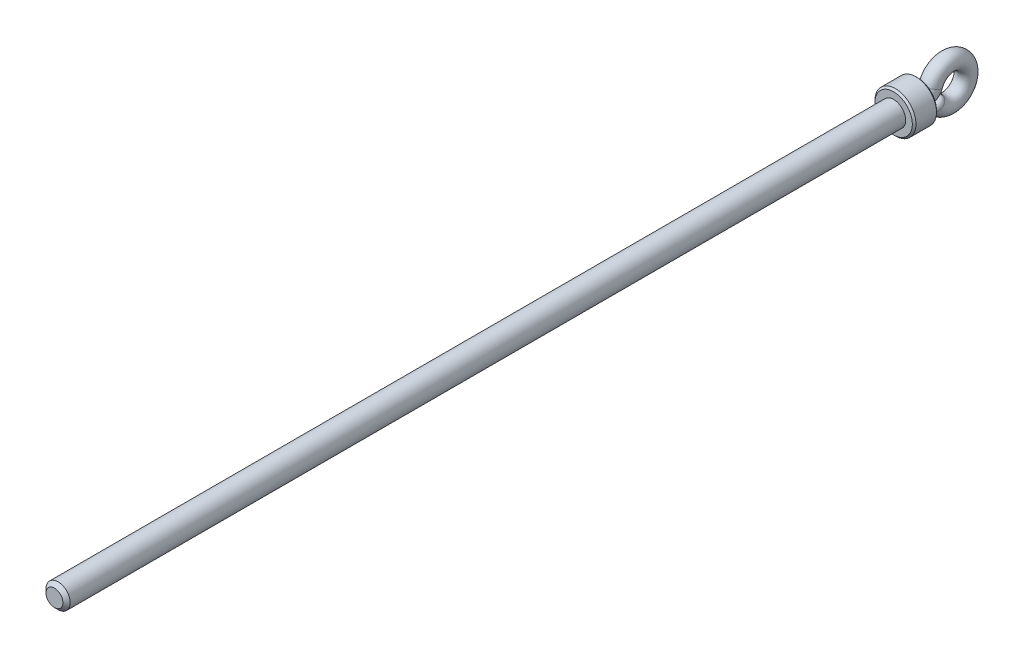
ISO-10303-21;
HEADER;
FILE_DESCRIPTION(('STEP AP214'),'2;1');
FILE_NAME('part.step','',(''),(''),'','','');
FILE_SCHEMA(('AUTOMOTIVE_DESIGN { 1 0 10303 214 1 1 1 1 }'));
ENDSEC;
DATA;
#1=APPLICATION_CONTEXT('core data for automotive mechanical design processes');
#2=APPLICATION_PROTOCOL_DEFINITION('international standard','automotive_design',2000,#1);
#3=PRODUCT_CONTEXT('',#1,'mechanical');
#4=PRODUCT('Part','Part','',(#3));
#5=PRODUCT_RELATED_PRODUCT_CATEGORY('part','',(#4));
#6=PRODUCT_DEFINITION_FORMATION('','',#4);
#7=PRODUCT_DEFINITION_CONTEXT('part definition',#1,'design');
#8=PRODUCT_DEFINITION('design','',#6,#7);
#9=PRODUCT_DEFINITION_SHAPE('','',#8);
#10=(LENGTH_UNIT() NAMED_UNIT(*) SI_UNIT(.MILLI.,.METRE.));
#11=(NAMED_UNIT(*) PLANE_ANGLE_UNIT() SI_UNIT($,.RADIAN.));
#12=(NAMED_UNIT(*) SI_UNIT($,.STERADIAN.) SOLID_ANGLE_UNIT());
#13=UNCERTAINTY_MEASURE_WITH_UNIT(LENGTH_MEASURE(1.E-05),#10,'distance_accuracy_value','');
#14=(GEOMETRIC_REPRESENTATION_CONTEXT(3) GLOBAL_UNCERTAINTY_ASSIGNED_CONTEXT((#13)) GLOBAL_UNIT_ASSIGNED_CONTEXT((#10,
#11,#12)) REPRESENTATION_CONTEXT('',''));
#15=CARTESIAN_POINT('',(0.,0.,0.));
#16=DIRECTION('',(0.,0.,1.));
#17=DIRECTION('',(1.,0.,0.));
#18=AXIS2_PLACEMENT_3D('',#15,#16,#17);
#19=CARTESIAN_POINT('',(0.,0.,695.));
#20=DIRECTION('',(0.,0.,-1.));
#21=DIRECTION('',(-1.,0.,0.));
#22=AXIS2_PLACEMENT_3D('',#19,#20,#21);
#23=CYLINDRICAL_SURFACE('',#22,10.);
#24=CARTESIAN_POINT('',(0.,0.,692.));
#25=DIRECTION('',(0.,0.,1.));
#26=DIRECTION('',(1.,0.,0.));
#27=AXIS2_PLACEMENT_3D('',#24,#25,#26);
#28=CIRCLE('',#27,10.);
#29=CARTESIAN_POINT('',(10.,0.,692.));
#30=VERTEX_POINT('',#29);
#31=EDGE_CURVE('E27',#30,#30,#28,.F.);
#32=ORIENTED_EDGE('',*,*,#31,.T.);
#33=EDGE_LOOP('',(#32));
#34=FACE_BOUND('',#33,.T.);
#35=CARTESIAN_POINT('',(0.,0.,0.));
#36=DIRECTION('',(0.,0.,1.));
#37=DIRECTION('',(1.,0.,0.));
#38=AXIS2_PLACEMENT_3D('',#35,#36,#37);
#39=CIRCLE('',#38,10.);
#40=CARTESIAN_POINT('',(10.,0.,0.));
#41=VERTEX_POINT('',#40);
#42=EDGE_CURVE('E130',#41,#41,#39,.T.);
#43=ORIENTED_EDGE('',*,*,#42,.T.);
#44=EDGE_LOOP('',(#43));
#45=FACE_BOUND('',#44,.T.);
#46=ADVANCED_FACE('F12',(#34,#45),#23,.T.);
#47=CARTESIAN_POINT('',(0.,0.,695.));
#48=DIRECTION('',(0.,0.,1.));
#49=DIRECTION('',(1.,0.,0.));
#50=AXIS2_PLACEMENT_3D('',#47,#48,#49);
#51=PLANE('',#50);
#52=CARTESIAN_POINT('',(0.,0.,695.));
#53=DIRECTION('',(0.,0.,1.));
#54=DIRECTION('',(1.,0.,0.));
#55=AXIS2_PLACEMENT_3D('',#52,#53,#54);
#56=CIRCLE('',#55,7.);
#57=CARTESIAN_POINT('',(7.,0.,695.));
#58=VERTEX_POINT('',#57);
#59=EDGE_CURVE('E110',#58,#58,#56,.T.);
#60=ORIENTED_EDGE('',*,*,#59,.T.);
#61=EDGE_LOOP('',(#60));
#62=FACE_BOUND('',#61,.T.);
#63=ADVANCED_FACE('F77',(#62),#51,.T.);
#64=CARTESIAN_POINT('',(0.,0.,-20.));
#65=DIRECTION('',(0.,0.,1.));
#66=DIRECTION('',(1.,0.,0.));
#67=AXIS2_PLACEMENT_3D('',#64,#65,#66);
#68=CYLINDRICAL_SURFACE('',#67,17.);
#69=CARTESIAN_POINT('',(0.,0.,-1.49999999999992));
#70=DIRECTION('',(0.,0.,1.));
#71=DIRECTION('',(1.,0.,0.));
#72=AXIS2_PLACEMENT_3D('',#69,#70,#71);
#73=CIRCLE('',#72,17.);
#74=CARTESIAN_POINT('',(17.,0.,-1.49999999999992));
#75=VERTEX_POINT('',#74);
#76=EDGE_CURVE('E121',#75,#75,#73,.F.);
#77=ORIENTED_EDGE('',*,*,#76,.T.);
#78=EDGE_LOOP('',(#77));
#79=FACE_BOUND('',#78,.T.);
#80=CARTESIAN_POINT('',(0.,0.,-18.5));
#81=DIRECTION('',(0.,0.,1.));
#82=DIRECTION('',(1.,0.,0.));
#83=AXIS2_PLACEMENT_3D('',#80,#81,#82);
#84=CIRCLE('',#83,17.);
#85=CARTESIAN_POINT('',(17.,0.,-18.5));
#86=VERTEX_POINT('',#85);
#87=EDGE_CURVE('E124',#86,#86,#84,.T.);
#88=ORIENTED_EDGE('',*,*,#87,.T.);
#89=EDGE_LOOP('',(#88));
#90=FACE_BOUND('',#89,.T.);
#91=ADVANCED_FACE('F84',(#79,#90),#68,.T.);
#92=CARTESIAN_POINT('',(0.,0.,-20.));
#93=DIRECTION('',(0.,0.,1.));
#94=DIRECTION('',(1.,0.,0.));
#95=AXIS2_PLACEMENT_3D('',#92,#93,#94);
#96=PLANE('',#95);
#97=CARTESIAN_POINT('',(0.,0.,-20.));
#98=DIRECTION('',(0.,0.,1.));
#99=DIRECTION('',(1.,0.,0.));
#100=AXIS2_PLACEMENT_3D('',#97,#98,#99);
#101=CIRCLE('',#100,9.);
#102=CARTESIAN_POINT('',(9.,0.,-20.));
#103=VERTEX_POINT('',#102);
#104=EDGE_CURVE('E113',#103,#103,#101,.T.);
#105=ORIENTED_EDGE('',*,*,#104,.T.);
#106=EDGE_LOOP('',(#105));
#107=FACE_BOUND('',#106,.T.);
#108=CARTESIAN_POINT('',(0.,0.,-20.));
#109=DIRECTION('',(0.,0.,1.));
#110=DIRECTION('',(1.,0.,0.));
#111=AXIS2_PLACEMENT_3D('',#108,#109,#110);
#112=CIRCLE('',#111,15.5);
#113=CARTESIAN_POINT('',(15.5,0.,-20.));
#114=VERTEX_POINT('',#113);
#115=EDGE_CURVE('E118',#114,#114,#112,.F.);
#116=ORIENTED_EDGE('',*,*,#115,.T.);
#117=EDGE_LOOP('',(#116));
#118=FACE_BOUND('',#117,.T.);
#119=ADVANCED_FACE('F145',(#107,#118),#96,.F.);
#120=CARTESIAN_POINT('',(0.,0.,0.));
#121=DIRECTION('',(0.,0.,1.));
#122=DIRECTION('',(1.,0.,0.));
#123=AXIS2_PLACEMENT_3D('',#120,#121,#122);
#124=PLANE('',#123);
#125=CARTESIAN_POINT('',(0.,0.,0.));
#126=DIRECTION('',(0.,0.,1.));
#127=DIRECTION('',(1.,0.,0.));
#128=AXIS2_PLACEMENT_3D('',#125,#126,#127);
#129=CIRCLE('',#128,15.5);
#130=CARTESIAN_POINT('',(15.5,0.,0.));
#131=VERTEX_POINT('',#130);
#132=EDGE_CURVE('E127',#131,#131,#129,.T.);
#133=ORIENTED_EDGE('',*,*,#132,.T.);
#134=EDGE_LOOP('',(#133));
#135=FACE_BOUND('',#134,.T.);
#136=ORIENTED_EDGE('',*,*,#42,.F.);
#137=EDGE_LOOP('',(#136));
#138=FACE_BOUND('',#137,.T.);
#139=ADVANCED_FACE('F61',(#135,#138),#124,.T.);
#140=CARTESIAN_POINT('',(0.,-5.6190989012386,-31.0922421814982));
#141=DIRECTION('',(0.,-0.92718385456679,-0.374606593415906));
#142=DIRECTION('',(0.,0.374606593415906,-0.92718385456679));
#143=AXIS2_PLACEMENT_3D('',#140,#141,#142);
#144=PLANE('',#143);
#145=CARTESIAN_POINT('',(-0.26781489975325,-4.24294874486967,-34.4983333418537));
#146=CARTESIAN_POINT('',(-0.535964039163624,-3.18618303783896,-37.1139202504667));
#147=CARTESIAN_POINT('',(-0.624901432757583,-5.31433814850182,-38.9828767941055));
#148=CARTESIAN_POINT('',(-0.106699811893944,-4.23721080551918,-34.5125352401058));
#149=CARTESIAN_POINT('',(-0.213372702047784,-3.17709115436086,-37.1364234517361));
#150=CARTESIAN_POINT('',(-0.248966227724355,-5.29458411469506,-39.010392555168));
#151=CARTESIAN_POINT('',(0.0557192743773804,-4.23666309919185,-34.5138908608361));
#152=CARTESIAN_POINT('',(0.111416626490463,-3.17622472220717,-37.1385679465691));
#153=CARTESIAN_POINT('',(0.130011640243445,-5.29269527178392,-39.0130149226403));
#154=CARTESIAN_POINT('',(0.37840606743683,-4.2459646647267,-34.4908686782646));
#155=CARTESIAN_POINT('',(0.757583451588221,-3.1909667929823,-37.1020800410014));
#156=CARTESIAN_POINT('',(0.88294749069947,-5.32472333482807,-38.9684170545827));
#157=CARTESIAN_POINT('',(0.538674013800433,-4.25581276889775,-34.4664937650998));
#158=CARTESIAN_POINT('',(1.07983936736786,-3.20661368418199,-37.0633526262963));
#159=CARTESIAN_POINT('',(1.25690603219714,-5.35863621941737,-38.9212024169066));
#160=CARTESIAN_POINT('',(0.850088972014334,-4.28527806984583,-34.3935645860912));
#161=CARTESIAN_POINT('',(1.71070497526708,-3.25374810830346,-36.9466908328098));
#162=CARTESIAN_POINT('',(1.98354093470391,-5.4597559099278,-38.7795031073017));
#163=CARTESIAN_POINT('',(1.00133655074528,-4.30474694972162,-34.3453774174599));
#164=CARTESIAN_POINT('',(2.02022082468755,-3.28511609734603,-36.8690523355125));
#165=CARTESIAN_POINT('',(2.33645195176722,-5.52645716066194,-38.6857360033921));
#166=CARTESIAN_POINT('',(1.29332499429875,-4.35265493436787,-34.2268009944883));
#167=CARTESIAN_POINT('',(2.62575498343677,-3.36316682901066,-36.6758699956698));
#168=CARTESIAN_POINT('',(3.01775832005989,-5.68980738952441,-38.4540301378223));
#169=CARTESIAN_POINT('',(1.43406464981,-4.38109506963931,-34.1564091895686));
#170=CARTESIAN_POINT('',(2.92236085455471,-3.41003385837553,-36.5598700274301));
#171=CARTESIAN_POINT('',(3.34615084956293,-5.78645980803031,-38.3160863016868));
#172=CARTESIAN_POINT('',(1.70559193340705,-4.44694228423317,-33.9934316143933));
#173=CARTESIAN_POINT('',(3.50581556944885,-3.52019578102392,-36.287209700936));
#174=CARTESIAN_POINT('',(3.97971451127665,-6.00891158281849,-37.99509911499));
#175=CARTESIAN_POINT('',(1.8359668712502,-4.48458778863466,-33.9002557213589));
#176=CARTESIAN_POINT('',(3.79246172010585,-3.58416094446186,-36.1288903658342));
#177=CARTESIAN_POINT('',(4.28392269958882,-6.13548232047447,-37.8108522184166));
#178=CARTESIAN_POINT('',(2.07903816647017,-4.56717462556752,-33.6958461270011));
#179=CARTESIAN_POINT('',(4.34129872883697,-3.72715987201688,-35.7749556001901));
#180=CARTESIAN_POINT('',(4.85108905510651,-6.41121009640482,-37.404353267778));
#181=CARTESIAN_POINT('',(2.19173041569785,-4.61211764858217,-33.5846082415848));
#182=CARTESIAN_POINT('',(4.60364524530678,-3.80646547441347,-35.5786673462961));
#183=CARTESIAN_POINT('',(5.1140376366307,-6.56037236750889,-37.182092407072));
#184=CARTESIAN_POINT('',(2.4023148160031,-4.71048518827117,-33.3411400372976));
#185=CARTESIAN_POINT('',(5.1114247936726,-3.98388725587502,-35.1395330274908));
#186=CARTESIAN_POINT('',(5.60540123733802,-6.88438053582401,-36.6927903523806));
#187=CARTESIAN_POINT('',(2.49915407592638,-4.76422609928738,-33.2081266149508));
#188=CARTESIAN_POINT('',(5.35503971113458,-4.08300472606899,-34.8942086800699));
#189=CARTESIAN_POINT('',(5.83135951049496,-7.06015030018004,-36.4240392911956));
#190=CARTESIAN_POINT('',(2.6685229621291,-4.87683900319798,-32.9293998969566));
#191=CARTESIAN_POINT('',(5.80290163873662,-4.29594611758229,-34.3671602413871));
#192=CARTESIAN_POINT('',(6.22655357830285,-7.42544617922707,-35.8575021364479));
#193=CARTESIAN_POINT('',(2.74104712599448,-4.93571214531601,-32.783683756881));
#194=CARTESIAN_POINT('',(6.00674674067441,-4.41005227440125,-34.0847375927507));
#195=CARTESIAN_POINT('',(6.39577662732097,-7.61497537337143,-35.559709538041));
#196=CARTESIAN_POINT('',(2.86267410632611,-5.05958707808985,-32.4770825393046));
#197=CARTESIAN_POINT('',(6.37581947811974,-4.65663337946306,-33.4744279413113));
#198=CARTESIAN_POINT('',(6.67957291476038,-8.01050509923216,-34.9296020277956));
#199=CARTESIAN_POINT('',(2.91066484290466,-5.1247424378163,-32.3158173650161));
#200=CARTESIAN_POINT('',(6.53823980201787,-4.78984889319113,-33.1447079746118));
#201=CARTESIAN_POINT('',(6.79155130011043,-8.21686310599564,-34.5963623398275));
#202=CARTESIAN_POINT('',(2.97723912694889,-5.25713277767882,-31.988139775303));
#203=CARTESIAN_POINT('',(6.80459024537532,-5.06828018911196,-32.4555663344985));
#204=CARTESIAN_POINT('',(6.94689129621409,-8.63273005456193,-33.9156505539855));
#205=CARTESIAN_POINT('',(2.99581930203228,-5.32436799540215,-31.8217267718294));
#206=CARTESIAN_POINT('',(6.90756393001704,-5.21365603767942,-32.095748482905));
#207=CARTESIAN_POINT('',(6.99024503807571,-8.84223935492986,-33.5681768286417));
#208=CARTESIAN_POINT('',(3.00297095485652,-5.46003619821919,-31.4859361866104));
#209=CARTESIAN_POINT('',(7.04792453219719,-5.51541300187754,-31.3488737878914));
#210=CARTESIAN_POINT('',(7.00693222799816,-9.26175749724208,-32.8637583462609));
#211=CARTESIAN_POINT('',(2.99110810652139,-5.52847252902019,-31.3165503239488));
#212=CARTESIAN_POINT('',(7.08320525408175,-5.67193252423054,-30.9614743758124));
#213=CARTESIAN_POINT('',(6.97925224854835,-9.47173038745556,-32.506749230534));
#214=CARTESIAN_POINT('',(2.93647501381529,-5.66359719160117,-30.9821050480222));
#215=CARTESIAN_POINT('',(7.07764622811232,-5.98967234228319,-30.1750407293434));
#216=CARTESIAN_POINT('',(6.85177503223626,-9.88339870069764,-31.7989770209835));
#217=CARTESIAN_POINT('',(2.89370596052631,-5.73028559064138,-30.8170454682824));
#218=CARTESIAN_POINT('',(7.03563962131795,-6.15079719396174,-29.7762427271952));
#219=CARTESIAN_POINT('',(6.75198057456525,-10.0850944423994,-31.44821368699));
#220=CARTESIAN_POINT('',(2.7788499410562,-5.8590731149157,-30.498285160067));
#221=CARTESIAN_POINT('',(6.87093161465208,-6.47018696868092,-28.9857252946721));
#222=CARTESIAN_POINT('',(6.483983195794,-10.4721971890889,-30.7685131820488));
#223=CARTESIAN_POINT('',(2.70714713847289,-5.9212202351783,-30.3444656397274));
#224=CARTESIAN_POINT('',(6.74822619668567,-6.62826029452504,-28.5944800839996));
#225=CARTESIAN_POINT('',(6.31667665642216,-10.6577803335356,-30.4393533096008));
#226=CARTESIAN_POINT('',(2.53613119994427,-6.03993497912506,-30.0506363376781));
#227=CARTESIAN_POINT('',(6.42064236153452,-6.93744162777072,-27.8292294307615));
#228=CARTESIAN_POINT('',(5.91763946652359,-11.0104370540509,-29.8088517089643));
#229=CARTESIAN_POINT('',(2.43682318052268,-6.09650363412718,-29.9106240033669));
#230=CARTESIAN_POINT('',(6.21498311331832,-7.08820123680676,-27.4560863044102));
#231=CARTESIAN_POINT('',(5.68592075455223,-11.177514052147,-29.5075048395134));
#232=CARTESIAN_POINT('',(2.21636936017603,-6.2007470634353,-29.6526124619313));
#233=CARTESIAN_POINT('',(5.73013766037579,-7.37181670926835,-26.754113377095));
#234=CARTESIAN_POINT('',(5.1715285070781,-11.4840832244933,-28.950979202246));
#235=CARTESIAN_POINT('',(2.09591453127465,-6.24862686251162,-29.5341058006933));
#236=CARTESIAN_POINT('',(5.45269078156247,-7.50469196855701,-26.4252355696854));
#237=CARTESIAN_POINT('',(4.89046723963124,-11.624217886761,-28.6947422138669));
#238=CARTESIAN_POINT('',(1.83464081316523,-6.33585912965116,-29.3181983631025));
#239=CARTESIAN_POINT('',(4.82763579395749,-7.75093360432912,-25.8157661342221));
#240=CARTESIAN_POINT('',(4.28082856405544,-11.8786970961703,-28.22715060489));
#241=CARTESIAN_POINT('',(1.69382006872958,-6.37521082003178,-29.2207995115817));
#242=CARTESIAN_POINT('',(4.48000858770837,-7.8638650581632,-25.5362509775002));
#243=CARTESIAN_POINT('',(3.95224682706208,-11.9930392913223,-28.0158000775467));
#244=CARTESIAN_POINT('',(1.40028972794922,-6.4430518984287,-29.0528869503199));
#245=CARTESIAN_POINT('',(3.73660921746578,-8.06115492934167,-25.0479414110341));
#246=CARTESIAN_POINT('',(3.26734269852263,-12.1896978973501,-27.6510240868038));
#247=CARTESIAN_POINT('',(1.24804435611005,-6.4718236334829,-28.9816744071373));
#248=CARTESIAN_POINT('',(3.34282932990736,-8.14588937924191,-24.8382162880546));
#249=CARTESIAN_POINT('',(2.91210349749228,-12.2728481817796,-27.496094226833));
#250=CARTESIAN_POINT('',(0.932747091781657,-6.51910388164867,-28.8646516864759));
#251=CARTESIAN_POINT('',(2.51384420994788,-8.28641586853572,-24.4904010218467));
#252=CARTESIAN_POINT('',(2.1764098807299,-12.4092924860004,-27.241326667381));
#253=CARTESIAN_POINT('',(0.769710861092857,-6.53762691917467,-28.81880555981));
#254=CARTESIAN_POINT('',(2.07939645923682,-8.34195358605521,-24.3529403473455));
#255=CARTESIAN_POINT('',(1.79599200919866,-12.4626287592013,-27.1414110029766));
#256=CARTESIAN_POINT('',(0.504559541538936,-6.55856746018864,-28.7669759020429));
#257=CARTESIAN_POINT('',(1.36676595853376,-8.40503161707912,-24.1968167420188));
#258=CARTESIAN_POINT('',(1.17730559693497,-12.5228887941041,-27.0284221432914));
#259=CARTESIAN_POINT('',(0.404312496262395,-6.5644661816725,-28.7523760540462));
#260=CARTESIAN_POINT('',(1.09603956052915,-8.42286039325097,-24.1526889725033));
#261=CARTESIAN_POINT('',(0.943395824613106,-12.5398515840755,-26.9965840252859));
#262=CARTESIAN_POINT('',(0.202725883288977,-6.57234286012486,-28.7328805907602));
#263=CARTESIAN_POINT('',(0.550143007606997,-8.44670511194333,-24.0936712227445));
#264=CARTESIAN_POINT('',(0.473027060999228,-12.5624983513959,-26.9540664581323));
#265=CARTESIAN_POINT('',(0.101386327901201,-6.57432086122103,-28.727984866251));
#266=CARTESIAN_POINT('',(0.275190979382257,-8.45270188381369,-24.0788286915253));
#267=CARTESIAN_POINT('',(0.236568098428446,-12.5681824556865,-26.9433867708463));
#268=CARTESIAN_POINT('',(-0.165237092147791,-6.57431605344368,-28.7279967659176));
#269=CARTESIAN_POINT('',(-0.448499740087205,-8.45268614664153,-24.0788676423932));
#270=CARTESIAN_POINT('',(-0.385553214998982,-12.5681698511401,-26.9434137921354));
#271=CARTESIAN_POINT('',(-0.330598420166324,-6.56905430543397,-28.7410200492424));
#272=CARTESIAN_POINT('',(-0.896849121504694,-8.43673745589875,-24.1183420371798));
#273=CARTESIAN_POINT('',(-0.771396313677785,-12.5530513462082,-26.9718249240442));
#274=CARTESIAN_POINT('',(-0.656720245210438,-6.5481568360175,-28.7927431010647));
#275=CARTESIAN_POINT('',(-1.77657720646738,-8.37363171091724,-24.2745342369586));
#276=CARTESIAN_POINT('',(-1.5323472387816,-12.4929374464877,-27.0846009430528));
#277=CARTESIAN_POINT('',(-0.817474803317346,-6.53250830110107,-28.8314745841116));
#278=CARTESIAN_POINT('',(-2.20702699852984,-8.32657126632454,-24.3910129246859));
#279=CARTESIAN_POINT('',(-1.90744120772978,-12.447905148927,-27.1690349419062));
#280=CARTESIAN_POINT('',(-1.1295537145794,-6.4913478415649,-28.9333502963902));
#281=CARTESIAN_POINT('',(-3.03315971448819,-8.20372522900592,-24.6950675366475));
#282=CARTESIAN_POINT('',(-2.6356253340293,-12.329222364088,-27.3909154754928));
#283=CARTESIAN_POINT('',(-1.28088682483041,-6.46584524001854,-28.9964714502055));
#284=CARTESIAN_POINT('',(-3.42815911377846,-8.12821704941378,-24.8819568392814));
#285=CARTESIAN_POINT('',(-2.98873592460434,-12.2555989269648,-27.5283119014236));
#286=CARTESIAN_POINT('',(-1.57007644312574,-6.40577953460373,-29.1451392880189));
#287=CARTESIAN_POINT('',(-4.16927867998277,-7.95235857172891,-25.317221845461));
#288=CARTESIAN_POINT('',(-3.66351170062292,-12.0817197266258,-27.8514948458113));
#289=CARTESIAN_POINT('',(-1.70793593426102,-6.37121844257365,-29.2306809925422));
#290=CARTESIAN_POINT('',(-4.51497923938366,-7.85234276624687,-25.5647696507435));
#291=CARTESIAN_POINT('',(-3.98518384661203,-11.9814698769164,-28.0372706194358));
#292=CARTESIAN_POINT('',(-1.967863123793,-6.29370238387418,-29.4225399703579));
#293=CARTESIAN_POINT('',(-5.14972343050823,-7.63126996421922,-26.1119440366901));
#294=CARTESIAN_POINT('',(-4.59168062218071,-11.7558350754682,-28.453232261639));
#295=CARTESIAN_POINT('',(-2.08976377541198,-6.25066887428398,-29.529051644201));
#296=CARTESIAN_POINT('',(-5.43810290132606,-7.51038127971641,-26.4111540304297));
#297=CARTESIAN_POINT('',(-4.87611547594543,-11.6302146221968,-28.6838334054978));
#298=CARTESIAN_POINT('',(-2.31309727203605,-6.15770426512614,-29.7591471261606));
#299=CARTESIAN_POINT('',(-5.94668038335635,-7.25381463730368,-27.0461787540907));
#300=CARTESIAN_POINT('',(-5.39722696806795,-11.3576735593833,-29.1809325311169));
#301=CARTESIAN_POINT('',(-2.41452738539324,-6.1077722464971,-29.8827332090338));
#302=CARTESIAN_POINT('',(-6.16710259168333,-7.11849846276231,-27.3810980387526));
#303=CARTESIAN_POINT('',(-5.6338972325806,-11.2107501115972,-29.4474352957917));
#304=CARTESIAN_POINT('',(-2.59668038527519,-6.00116740182763,-30.1465894585857));
#305=CARTESIAN_POINT('',(-6.54073421000398,-6.83544924507485,-28.0816694363206));
#306=CARTESIAN_POINT('',(-6.05892089897921,-10.8954931546131,-30.0149538201396));
#307=CARTESIAN_POINT('',(-2.67684921633415,-5.94436178532915,-30.2871882931814));
#308=CARTESIAN_POINT('',(-6.6928157610258,-6.68778972125285,-28.4471395825142));
#309=CARTESIAN_POINT('',(-6.24598150477781,-10.7267311856226,-30.3166432456417));
#310=CARTESIAN_POINT('',(-2.81141791503929,-5.82662073790983,-30.5786076117564));
#311=CARTESIAN_POINT('',(-6.92206836095539,-6.38870384901209,-29.1874030929398));
#312=CARTESIAN_POINT('',(-6.55997513508735,-10.3748867902622,-30.9400082050122));
#313=CARTESIAN_POINT('',(-2.86581410690899,-5.7656847193136,-30.7294295502834));
#314=CARTESIAN_POINT('',(-7.00002752535391,-6.23752461902532,-29.5615848175897));
#315=CARTESIAN_POINT('',(-6.68689958278649,-10.1918023255077,-31.261686582373));
#316=CARTESIAN_POINT('',(-2.94897598749161,-5.63949857186401,-31.0417512249192));
#317=CARTESIAN_POINT('',(-7.08546210507058,-5.93216835664194,-30.3173680882232));
#318=CARTESIAN_POINT('',(-6.88094397081495,-9.81020111189019,-31.9254171033893));
#319=CARTESIAN_POINT('',(-2.97693941011896,-5.57417423564641,-31.2034346306995));
#320=CARTESIAN_POINT('',(-7.09181436223383,-5.77812321895295,-30.6986431833499));
#321=CARTESIAN_POINT('',(-6.94619195694448,-9.61138862839215,-32.2677902753251));
#322=CARTESIAN_POINT('',(-3.00400264473196,-5.442691693058,-31.5288653433138));
#323=CARTESIAN_POINT('',(-7.0344080491124,-5.47620956196367,-31.4459057066309));
#324=CARTESIAN_POINT('',(-7.00933950437414,-9.20830719904836,-32.9539945343634));
#325=CARTESIAN_POINT('',(-3.00309807278968,-5.37653336156059,-31.692612959847));
#326=CARTESIAN_POINT('',(-6.97169088091767,-5.32837189857582,-31.811816763722));
#327=CARTESIAN_POINT('',(-7.0072288365091,-9.00403742915884,-33.2978258349719));
#328=CARTESIAN_POINT('',(-2.97226379285404,-5.2434339065651,-32.0220456711032));
#329=CARTESIAN_POINT('',(-6.78109424666209,-5.03896820801417,-32.5281160335613));
#330=CARTESIAN_POINT('',(-6.93528218332624,-8.58990410920829,-33.9862929927512));
#331=CARTESIAN_POINT('',(-2.94157953478853,-5.17651720011601,-32.1876703315093));
#332=CARTESIAN_POINT('',(-6.65256825978371,-4.89751561236647,-32.8782234934305));
#333=CARTESIAN_POINT('',(-6.86368558117342,-8.38003329544209,-34.3307170389853));
#334=CARTESIAN_POINT('',(-2.85096997132786,-5.04551528630781,-32.5119114461484));
#335=CARTESIAN_POINT('',(-6.3380914493453,-4.62815335371664,-33.5449184786212));
#336=CARTESIAN_POINT('',(-6.65226326643105,-7.96581341371869,-35.0014299241157));
#337=CARTESIAN_POINT('',(-2.791041290668,-4.98143040671719,-32.6705270891259));
#338=CARTESIAN_POINT('',(-6.1530122401549,-4.50004187549882,-33.8620055141299));
#339=CARTESIAN_POINT('',(-6.51242967822386,-7.76146498600523,-35.3277166648395));
#340=CARTESIAN_POINT('',(-2.64271969312056,-4.85730369762863,-32.9777514749488));
#341=CARTESIAN_POINT('',(-5.73212439282306,-4.2584602246541,-34.4599410821623));
#342=CARTESIAN_POINT('',(-6.16634595061608,-7.36243913289171,-35.9561759020384));
#343=CARTESIAN_POINT('',(-2.55405610709969,-4.79730715510843,-33.126248128591));
#344=CARTESIAN_POINT('',(-5.4964440307021,-4.14483256782397,-34.741179401767));
#345=CARTESIAN_POINT('',(-5.95946424990453,-7.16787484562069,-36.2580835617053));
#346=CARTESIAN_POINT('',(-2.35060582109397,-4.68387550682011,-33.4070013100308));
#347=CARTESIAN_POINT('',(-4.98400245652422,-3.93533758283828,-35.2596976849617));
#348=CARTESIAN_POINT('',(-5.48474691588555,-6.79714752840173,-36.8256230192002));
#349=CARTESIAN_POINT('',(-2.2358201549264,-4.63044014151316,-33.5392584802095));
#350=CARTESIAN_POINT('',(-4.70754737699064,-3.83911799344865,-35.4978495257011));
#351=CARTESIAN_POINT('',(-5.21691369481844,-6.62098377062994,-37.0912562519731));
#352=CARTESIAN_POINT('',(-1.98546547851585,-4.53286402953774,-33.7807678321673));
#353=CARTESIAN_POINT('',(-4.12730577403506,-3.66728339495907,-35.9231550813848));
#354=CARTESIAN_POINT('',(-4.63275278321325,-6.29704641647726,-37.5736856392027));
#355=CARTESIAN_POINT('',(-1.85033996382723,-4.48856390973796,-33.8904144762885));
#356=CARTESIAN_POINT('',(-3.82414878836827,-3.59097237799393,-36.112031476246));
#357=CARTESIAN_POINT('',(-4.31745991563457,-6.14879083423837,-37.7913248227226));
#358=CARTESIAN_POINT('',(-1.56131231392031,-4.40959814038689,-34.0858616138793));
#359=CARTESIAN_POINT('',(-3.1935772150341,-3.45742146293027,-36.4425815903818));
#360=CARTESIAN_POINT('',(-3.64306206583902,-5.88302968473248,-38.1774757460196));
#361=CARTESIAN_POINT('',(-1.40741605342387,-4.37492948753143,-34.1716695407875));
#362=CARTESIAN_POINT('',(-2.86574251873185,-3.39984359530071,-36.5850918135995));
#363=CARTESIAN_POINT('',(-3.28397079130649,-5.76551453258945,-38.3460028008478));
#364=CARTESIAN_POINT('',(-1.09303354582871,-4.3180297078706,-34.3125014373883));
#365=CARTESIAN_POINT('',(-2.20906449564348,-3.30662991005436,-36.8158037805112));
#366=CARTESIAN_POINT('',(-2.55041160694879,-5.57187099924453,-38.6216468005123));
#367=CARTESIAN_POINT('',(-0.933210394927673,-4.29528479570718,-34.3687970704661));
#368=CARTESIAN_POINT('',(-1.88044231306173,-3.26985154109047,-36.9068334380238));
#369=CARTESIAN_POINT('',(-2.17749092157961,-5.49403784440166,-38.7313065637311));
#370=CARTESIAN_POINT('',(-0.605342130105582,-4.26076431514311,-34.4542382580838));
#371=CARTESIAN_POINT('',(-1.21427168553866,-3.21450025580672,-37.0438326765493));
#372=CARTESIAN_POINT('',(-1.4124649703353,-5.37566830736179,-38.8974393176043));
#373=CARTESIAN_POINT('',(-0.437300017329103,-4.24898477376295,-34.4833936460931));
#374=CARTESIAN_POINT('',(-0.875838035914693,-3.19576201414787,-37.0902114521353));
#375=CARTESIAN_POINT('',(-1.02036670713088,-5.33511841673628,-38.9539315720234));
#376=CARTESIAN_POINT('',(-0.26781489975325,-4.24294874486967,-34.4983333418537));
#377=CARTESIAN_POINT('',(-0.535964039163624,-3.18618303783896,-37.1139202504667));
#378=CARTESIAN_POINT('',(-0.624901432757583,-5.31433814850182,-38.9828767941055));
#379=(BOUNDED_SURFACE() B_SPLINE_SURFACE(3,2,((#145,#146,#147),(#148,#149,#150),(#151,#152,
#153),(#154,#155,#156),(#157,#158,#159),(#160,#161,#162),(#163,#164,#165),(#166,#167,#168),
(#169,#170,#171),(#172,#173,#174),(#175,#176,#177),(#178,#179,#180),(#181,#182,#183),(#184,#185,
#186),(#187,#188,#189),(#190,#191,#192),(#193,#194,#195),(#196,#197,#198),(#199,#200,#201),
(#202,#203,#204),(#205,#206,#207),(#208,#209,#210),(#211,#212,#213),(#214,#215,#216),(#217,#218,
#219),(#220,#221,#222),(#223,#224,#225),(#226,#227,#228),(#229,#230,#231),(#232,#233,#234),
(#235,#236,#237),(#238,#239,#240),(#241,#242,#243),(#244,#245,#246),(#247,#248,#249),(#250,#251,
#252),(#253,#254,#255),(#256,#257,#258),(#259,#260,#261),(#262,#263,#264),(#265,#266,#267),
(#268,#269,#270),(#271,#272,#273),(#274,#275,#276),(#277,#278,#279),(#280,#281,#282),(#283,#284,
#285),(#286,#287,#288),(#289,#290,#291),(#292,#293,#294),(#295,#296,#297),(#298,#299,#300),
(#301,#302,#303),(#304,#305,#306),(#307,#308,#309),(#310,#311,#312),(#313,#314,#315),(#316,#317,
#318),(#319,#320,#321),(#322,#323,#324),(#325,#326,#327),(#328,#329,#330),(#331,#332,#333),
(#334,#335,#336),(#337,#338,#339),(#340,#341,#342),(#343,#344,#345),(#346,#347,#348),(#349,#350,
#351),(#352,#353,#354),(#355,#356,#357),(#358,#359,#360),(#361,#362,#363),(#364,#365,#366),
(#367,#368,#369),(#370,#371,#372),(#373,#374,#375),(#376,#377,#378)),.UNSPECIFIED.,.T.,.F.,
.F.) B_SPLINE_SURFACE_WITH_KNOTS((4,2,2,2,2,2,2,2,2,2,2,2,2,2,2,2,2,2,2,2,2,2,2,2,2,2,2,2,2,2,2,
2,2,2,2,2,2,2,4),(3,3),(0.,0.484906264846497,0.969758069245281,1.44735806827545,
1.92501294776247,2.41667025983678,2.90844162812505,3.42538627880346,3.94244698399308,
4.48123213406688,5.02007905983656,5.56665623703479,6.11321235103519,6.65273863742297,
7.19216499123101,7.71645479841437,8.24079239575512,8.74989761023978,9.25827946256416,
9.56221187526015,9.86614086717984,10.3614773083335,10.8574259526719,11.3529065173159,
11.8482771316999,12.3484768464242,12.8487432651774,13.3609898282838,13.8733094276627,
14.400721633121,14.928213932404,15.4694302791303,16.0107091054845,16.5572423955035,
17.1037540594757,17.6397262744899,18.17553117346,18.6858135803125,19.1959110293021),(0.,1.),
.UNSPECIFIED.) GEOMETRIC_REPRESENTATION_ITEM() RATIONAL_B_SPLINE_SURFACE(((1.,0.81598755331536,
1.),(1.,0.816600922174567,1.),(1.,0.816659702119575,1.),(1.,0.815664998686587,1.),(1.,
0.814611640227578,1.),(1.,0.811484782161348,1.),(1.,0.80942677618711,1.),(1.,0.804418708735594,
1.),(1.,0.801468544780437,1.),(1.,0.794733377815299,1.),(1.,0.790926436806535,1.),(1.,
0.782715109891841,1.),(1.,0.778310585593635,1.),(1.,0.768849524284246,1.),(1.,0.763771152630643,
1.),(1.,0.753351141957016,1.),(1.,0.748009444089198,1.),(1.,0.737010717043995,1.),(1.,
0.731349868744407,1.),(1.,0.720103791794341,1.),(1.,0.714518571888633,1.),(1.,0.703492263754392,
1.),(1.,0.698054392693946,1.),(1.,0.687539448012322,1.),(1.,0.68246236049533,1.),(1.,
0.672842809885073,1.),(1.,0.668294310343447,1.),(1.,0.659749104511278,1.),(1.,0.65575229617208,
1.),(1.,0.648490086234698,1.),(1.,0.645207308076196,1.),(1.,0.639291985461389,1.),(1.,
0.636659500302577,1.),(1.,0.6321579192273,1.),(1.,0.630268867976811,1.),(1.,0.627180167799289,
1.),(1.,0.625979543148586,1.),(1.,0.624625198180392,1.),(1.,0.624244635266044,1.),(1.,
0.623736779399677,1.),(1.,0.623609483597137,1.),(1.,0.623609696254532,1.),(1.,0.623948162467291,
1.),(1.,0.625297953263754,1.),(1.,0.626310108939026,1.),(1.,0.628991015498397,1.),(1.,
0.630659145781885,1.),(1.,0.634625776555858,1.),(1.,0.636924137081079,1.),(1.,0.642141211291449,
1.),(1.,0.645065754045356,1.),(1.,0.651475007803571,1.),(1.,0.654959793456992,1.),(1.,
0.662522518643565,1.),(1.,0.666612664276948,1.),(1.,0.675248765877389,1.),(1.,0.679794786750875,
1.),(1.,0.689397782923427,1.),(1.,0.694465865330274,1.),(1.,0.70488797343684,1.),(1.,
0.710242042443574,1.),(1.,0.721251967379913,1.),(1.,0.72691205082702,1.),(1.,0.738242280753835,
1.),(1.,0.743912428319816,1.),(1.,0.755132062381896,1.),(1.,0.760679843231379,1.),(1.,
0.771378557833266,1.),(1.,0.776529507280023,1.),(1.,0.786098478080734,1.),(1.,0.790528718229196,
1.),(1.,0.798533119306611,1.),(1.,0.802107547048631,1.),(1.,0.808029374078311,1.),(1.,
0.810427111206527,1.),(1.,0.814083377645127,1.),(1.,0.815342319559779,1.),(1.,0.81598755331536,1.))) REPRESENTATION_ITEM('') SURFACE());
#380=CARTESIAN_POINT('',(-0.26781489975325,-4.24294874486967,-34.4983333418537));
#381=CARTESIAN_POINT('',(-0.437300017329103,-4.24898477376295,-34.4833936460931));
#382=CARTESIAN_POINT('',(-0.605342130105583,-4.26076431514311,-34.4542382580838));
#383=CARTESIAN_POINT('',(-0.933210394927673,-4.29528479570718,-34.3687970704661));
#384=CARTESIAN_POINT('',(-1.09303354582871,-4.3180297078706,-34.3125014373883));
#385=CARTESIAN_POINT('',(-1.40741605342387,-4.37492948753143,-34.1716695407875));
#386=CARTESIAN_POINT('',(-1.56131231392031,-4.40959814038689,-34.0858616138793));
#387=CARTESIAN_POINT('',(-1.85033996382723,-4.48856390973796,-33.8904144762885));
#388=CARTESIAN_POINT('',(-1.98546547851585,-4.53286402953774,-33.7807678321673));
#389=CARTESIAN_POINT('',(-2.2358201549264,-4.63044014151316,-33.5392584802095));
#390=CARTESIAN_POINT('',(-2.35060582109397,-4.68387550682011,-33.4070013100308));
#391=CARTESIAN_POINT('',(-2.55405610709969,-4.79730715510843,-33.126248128591));
#392=CARTESIAN_POINT('',(-2.64271969312056,-4.85730369762863,-32.9777514749488));
#393=CARTESIAN_POINT('',(-2.791041290668,-4.98143040671719,-32.6705270891259));
#394=CARTESIAN_POINT('',(-2.85096997132786,-5.04551528630781,-32.5119114461484));
#395=CARTESIAN_POINT('',(-2.94157953478853,-5.17651720011601,-32.1876703315093));
#396=CARTESIAN_POINT('',(-2.97226379285404,-5.2434339065651,-32.0220456711032));
#397=CARTESIAN_POINT('',(-3.00309807278968,-5.37653336156059,-31.692612959847));
#398=CARTESIAN_POINT('',(-3.00400264473196,-5.442691693058,-31.5288653433138));
#399=CARTESIAN_POINT('',(-2.97693941011896,-5.57417423564641,-31.2034346306995));
#400=CARTESIAN_POINT('',(-2.94897598749161,-5.63949857186401,-31.0417512249192));
#401=CARTESIAN_POINT('',(-2.86581410690899,-5.7656847193136,-30.7294295502834));
#402=CARTESIAN_POINT('',(-2.81141791503929,-5.82662073790983,-30.5786076117564));
#403=CARTESIAN_POINT('',(-2.67684921633415,-5.94436178532915,-30.2871882931814));
#404=CARTESIAN_POINT('',(-2.59668038527519,-6.00116740182764,-30.1465894585857));
#405=CARTESIAN_POINT('',(-2.41452738539324,-6.1077722464971,-29.8827332090338));
#406=CARTESIAN_POINT('',(-2.31309727203605,-6.15770426512614,-29.7591471261606));
#407=CARTESIAN_POINT('',(-2.08976377541198,-6.25066887428398,-29.529051644201));
#408=CARTESIAN_POINT('',(-1.967863123793,-6.29370238387418,-29.4225399703579));
#409=CARTESIAN_POINT('',(-1.70793593426103,-6.37121844257365,-29.2306809925422));
#410=CARTESIAN_POINT('',(-1.57007644312574,-6.40577953460373,-29.1451392880189));
#411=CARTESIAN_POINT('',(-1.28088682483041,-6.46584524001854,-28.9964714502055));
#412=CARTESIAN_POINT('',(-1.1295537145794,-6.4913478415649,-28.9333502963902));
#413=CARTESIAN_POINT('',(-0.817474803317346,-6.53250830110107,-28.8314745841116));
#414=CARTESIAN_POINT('',(-0.656720245210438,-6.5481568360175,-28.7927431010647));
#415=CARTESIAN_POINT('',(-0.330598420166324,-6.56905430543397,-28.7410200492424));
#416=CARTESIAN_POINT('',(-0.165237092147791,-6.57431605344368,-28.7279967659176));
#417=CARTESIAN_POINT('',(0.101386327901201,-6.57432086122103,-28.727984866251));
#418=CARTESIAN_POINT('',(0.202725883288977,-6.57234286012486,-28.7328805907602));
#419=CARTESIAN_POINT('',(0.404312496262394,-6.5644661816725,-28.7523760540462));
#420=CARTESIAN_POINT('',(0.504559541538936,-6.55856746018864,-28.7669759020429));
#421=CARTESIAN_POINT('',(0.769710861092858,-6.53762691917468,-28.81880555981));
#422=CARTESIAN_POINT('',(0.932747091781658,-6.51910388164867,-28.8646516864759));
#423=CARTESIAN_POINT('',(1.24804435611005,-6.4718236334829,-28.9816744071373));
#424=CARTESIAN_POINT('',(1.40028972794922,-6.4430518984287,-29.0528869503199));
#425=CARTESIAN_POINT('',(1.69382006872958,-6.37521082003178,-29.2207995115817));
#426=CARTESIAN_POINT('',(1.83464081316523,-6.33585912965116,-29.3181983631025));
#427=CARTESIAN_POINT('',(2.09591453127465,-6.24862686251162,-29.5341058006933));
#428=CARTESIAN_POINT('',(2.21636936017603,-6.2007470634353,-29.6526124619313));
#429=CARTESIAN_POINT('',(2.43682318052268,-6.09650363412718,-29.9106240033669));
#430=CARTESIAN_POINT('',(2.53613119994427,-6.03993497912506,-30.0506363376781));
#431=CARTESIAN_POINT('',(2.70714713847289,-5.9212202351783,-30.3444656397274));
#432=CARTESIAN_POINT('',(2.7788499410562,-5.8590731149157,-30.498285160067));
#433=CARTESIAN_POINT('',(2.89370596052631,-5.73028559064138,-30.8170454682824));
#434=CARTESIAN_POINT('',(2.93647501381529,-5.66359719160117,-30.9821050480222));
#435=CARTESIAN_POINT('',(2.99110810652139,-5.52847252902019,-31.3165503239488));
#436=CARTESIAN_POINT('',(3.00297095485652,-5.46003619821919,-31.4859361866104));
#437=CARTESIAN_POINT('',(2.99581930203228,-5.32436799540215,-31.8217267718294));
#438=CARTESIAN_POINT('',(2.97723912694889,-5.25713277767882,-31.988139775303));
#439=CARTESIAN_POINT('',(2.91066484290466,-5.1247424378163,-32.3158173650161));
#440=CARTESIAN_POINT('',(2.86267410632611,-5.05958707808985,-32.4770825393046));
#441=CARTESIAN_POINT('',(2.74104712599448,-4.93571214531601,-32.783683756881));
#442=CARTESIAN_POINT('',(2.6685229621291,-4.87683900319798,-32.9293998969566));
#443=CARTESIAN_POINT('',(2.49915407592638,-4.76422609928738,-33.2081266149508));
#444=CARTESIAN_POINT('',(2.4023148160031,-4.71048518827117,-33.3411400372976));
#445=CARTESIAN_POINT('',(2.19173041569785,-4.61211764858217,-33.5846082415848));
#446=CARTESIAN_POINT('',(2.07903816647017,-4.56717462556753,-33.6958461270011));
#447=CARTESIAN_POINT('',(1.8359668712502,-4.48458778863466,-33.9002557213589));
#448=CARTESIAN_POINT('',(1.70559193340705,-4.44694228423317,-33.9934316143933));
#449=CARTESIAN_POINT('',(1.43406464981,-4.38109506963931,-34.1564091895686));
#450=CARTESIAN_POINT('',(1.29332499429875,-4.35265493436787,-34.2268009944883));
#451=CARTESIAN_POINT('',(1.00133655074528,-4.30474694972162,-34.3453774174599));
#452=CARTESIAN_POINT('',(0.850088972014333,-4.28527806984583,-34.3935645860912));
#453=CARTESIAN_POINT('',(0.538674013800433,-4.25581276889775,-34.4664937650998));
#454=CARTESIAN_POINT('',(0.37840606743683,-4.2459646647267,-34.4908686782646));
#455=CARTESIAN_POINT('',(0.055719274377381,-4.23666309919185,-34.5138908608361));
#456=CARTESIAN_POINT('',(-0.106699811893943,-4.23721080551918,-34.5125352401058));
#457=CARTESIAN_POINT('',(-0.26781489975325,-4.24294874486967,-34.4983333418537));
#458=B_SPLINE_CURVE_WITH_KNOTS('',3,(#380,#381,#382,#383,#384,#385,#386,#387,#388,#389,#390,
#391,#392,#393,#394,#395,#396,#397,#398,#399,#400,#401,#402,#403,#404,#405,#406,#407,#408,#409,
#410,#411,#412,#413,#414,#415,#416,#417,#418,#419,#420,#421,#422,#423,#424,#425,#426,#427,#428,
#429,#430,#431,#432,#433,#434,#435,#436,#437,#438,#439,#440,#441,#442,#443,#444,#445,#446,#447,
#448,#449,#450,#451,#452,#453,#454,#455,#456,#457),.UNSPECIFIED.,.T.,.F.,(4,2,2,2,2,2,2,2,2,2,2,
2,2,2,2,2,2,2,2,2,2,2,2,2,2,2,2,2,2,2,2,2,2,2,2,2,2,2,4),(0.,0.510097448989649,1.02037985584212,
1.5561847548122,2.09215696982643,2.63866863379863,3.18520192381766,3.72648075017182,
4.26769709689814,4.79518939618112,5.32260160163939,5.83492120101829,6.34716776412475,
6.84743418287794,7.34763389760222,7.84300451198619,8.33848507663025,8.83443372096862,
9.32977016212229,9.63369915404198,9.93763156673798,10.4460134190624,10.955118633547,
11.4794562308878,12.0037460380711,12.5431723918792,13.0826986782669,13.6292547922673,
14.1758319694656,14.7146788952353,15.253464045309,15.7705247504987,16.2874694011771,
16.7792407694654,17.2708980815397,17.7485529610267,18.2261529600569,18.7110047644556,
19.1959110293021),.UNSPECIFIED.);
#459=CARTESIAN_POINT('',(-0.26781489975325,-4.24294874486967,-34.4983333418537));
#460=VERTEX_POINT('',#459);
#461=EDGE_CURVE('E8',#460,#460,#458,.T.);
#462=ORIENTED_EDGE('',*,*,#461,.T.);
#463=EDGE_LOOP('',(#462));
#464=FACE_BOUND('',#463,.T.);
#465=ADVANCED_FACE('F40',(#464),#144,.F.);
#466=CARTESIAN_POINT('',(0.,0.,-20.));
#467=DIRECTION('',(0.,0.,-1.));
#468=DIRECTION('',(0.,1.,0.));
#469=AXIS2_PLACEMENT_3D('',#466,#467,#468);
#470=CYLINDRICAL_SURFACE('',#469,7.);
#471=CARTESIAN_POINT('',(0.,0.,-22.));
#472=DIRECTION('',(0.,0.,1.));
#473=DIRECTION('',(1.,0.,0.));
#474=AXIS2_PLACEMENT_3D('',#471,#472,#473);
#475=CIRCLE('',#474,7.);
#476=CARTESIAN_POINT('',(7.,0.,-22.));
#477=VERTEX_POINT('',#476);
#478=EDGE_CURVE('E111',#477,#477,#475,.F.);
#479=ORIENTED_EDGE('',*,*,#478,.T.);
#480=EDGE_LOOP('',(#479));
#481=FACE_BOUND('',#480,.T.);
#482=CARTESIAN_POINT('',(0.,0.,-23.4361413471522));
#483=DIRECTION('',(0.,0.,1.));
#484=DIRECTION('',(0.,-1.,0.));
#485=AXIS2_PLACEMENT_3D('',#482,#483,#484);
#486=CIRCLE('',#485,7.);
#487=CARTESIAN_POINT('',(0.,-7.,-23.4361413471522));
#488=VERTEX_POINT('',#487);
#489=EDGE_CURVE('E136',#488,#488,#486,.T.);
#490=ORIENTED_EDGE('',*,*,#489,.T.);
#491=EDGE_LOOP('',(#490));
#492=FACE_BOUND('',#491,.T.);
#493=ADVANCED_FACE('F65',(#481,#492),#470,.T.);
#494=CARTESIAN_POINT('',(0.,8.,-23.4361413471522));
#495=DIRECTION('',(1.,0.,0.));
#496=DIRECTION('',(0.,0.,-1.));
#497=AXIS2_PLACEMENT_3D('',#494,#495,#496);
#498=TOROIDAL_SURFACE('',#497,8.,7.);
#499=CARTESIAN_POINT('',(0.,5.21739130434781,-30.9366139220558));
#500=DIRECTION('',(0.,-0.937559071862949,0.347826086956523));
#501=DIRECTION('',(0.,-0.347826086956523,-0.937559071862949));
#502=AXIS2_PLACEMENT_3D('',#499,#500,#501);
#503=CIRCLE('',#502,7.);
#504=CARTESIAN_POINT('',(0.,2.78260869565215,-37.4995274250964));
#505=VERTEX_POINT('',#504);
#506=EDGE_CURVE('E133',#505,#505,#503,.T.);
#507=CARTESIAN_POINT('',(0.,8.,-23.4361413471522));
#508=DIRECTION('',(1.,0.,0.));
#509=DIRECTION('',(0.,0.,-1.));
#510=AXIS2_PLACEMENT_3D('',#507,#508,#509);
#511=CIRCLE('',#510,15.);
#512=EDGE_CURVE('',#488,#505,#511,.T.);
#513=ORIENTED_EDGE('',*,*,#489,.F.);
#514=ORIENTED_EDGE('',*,*,#506,.T.);
#515=ORIENTED_EDGE('',*,*,#512,.T.);
#516=ORIENTED_EDGE('',*,*,#512,.F.);
#517=EDGE_LOOP('',(#513,#515,#514,#516));
#518=FACE_BOUND('',#517,.T.);
#519=ADVANCED_FACE('F59',(#518),#498,.T.);
#520=CARTESIAN_POINT('',(0.,0.,-45.));
#521=DIRECTION('',(-1.,0.,0.));
#522=DIRECTION('',(0.,0.,1.));
#523=AXIS2_PLACEMENT_3D('',#520,#521,#522);
#524=TOROIDAL_SURFACE('',#523,15.,7.);
#525=CARTESIAN_POINT('',(-0.624901432757583,-5.31433814850182,-38.9828767941055));
#526=CARTESIAN_POINT('',(-0.248966227724354,-5.29458411469506,-39.010392555168));
#527=CARTESIAN_POINT('',(0.130011640243446,-5.29269527178392,-39.0130149226403));
#528=CARTESIAN_POINT('',(0.88294749069947,-5.32472333482807,-38.9684170545827));
#529=CARTESIAN_POINT('',(1.25690603219714,-5.35863621941737,-38.9212024169066));
#530=CARTESIAN_POINT('',(1.98354093470391,-5.4597559099278,-38.7795031073017));
#531=CARTESIAN_POINT('',(2.33645195176722,-5.52645716066194,-38.6857360033921));
#532=CARTESIAN_POINT('',(3.01775832005989,-5.68980738952441,-38.4540301378223));
#533=CARTESIAN_POINT('',(3.34615084956293,-5.78645980803031,-38.3160863016868));
#534=CARTESIAN_POINT('',(3.97971451127665,-6.00891158281849,-37.99509911499));
#535=CARTESIAN_POINT('',(4.28392269958882,-6.13548232047447,-37.8108522184166));
#536=CARTESIAN_POINT('',(4.85108905510651,-6.41121009640482,-37.404353267778));
#537=CARTESIAN_POINT('',(5.1140376366307,-6.56037236750889,-37.182092407072));
#538=CARTESIAN_POINT('',(5.60540123733802,-6.88438053582401,-36.6927903523806));
#539=CARTESIAN_POINT('',(5.83135951049496,-7.06015030018004,-36.4240392911956));
#540=CARTESIAN_POINT('',(6.22655357830285,-7.42544617922707,-35.8575021364479));
#541=CARTESIAN_POINT('',(6.39577662732097,-7.61497537337143,-35.559709538041));
#542=CARTESIAN_POINT('',(6.67957291476038,-8.01050509923216,-34.9296020277956));
#543=CARTESIAN_POINT('',(6.79155130011043,-8.21686310599564,-34.5963623398275));
#544=CARTESIAN_POINT('',(6.94689129621409,-8.63273005456193,-33.9156505539855));
#545=CARTESIAN_POINT('',(6.99024503807571,-8.84223935492986,-33.5681768286417));
#546=CARTESIAN_POINT('',(7.00693222799815,-9.26175749724208,-32.863758346261));
#547=CARTESIAN_POINT('',(6.97925224854835,-9.47173038745556,-32.506749230534));
#548=CARTESIAN_POINT('',(6.85177503223626,-9.88339870069764,-31.7989770209835));
#549=CARTESIAN_POINT('',(6.75198057456525,-10.0850944423994,-31.44821368699));
#550=CARTESIAN_POINT('',(6.483983195794,-10.4721971890889,-30.7685131820488));
#551=CARTESIAN_POINT('',(6.31667665642216,-10.6577803335356,-30.4393533096008));
#552=CARTESIAN_POINT('',(5.91763946652359,-11.0104370540509,-29.8088517089643));
#553=CARTESIAN_POINT('',(5.68592075455223,-11.177514052147,-29.5075048395134));
#554=CARTESIAN_POINT('',(5.1715285070781,-11.4840832244933,-28.950979202246));
#555=CARTESIAN_POINT('',(4.89046723963124,-11.624217886761,-28.6947422138669));
#556=CARTESIAN_POINT('',(4.28082856405544,-11.8786970961703,-28.22715060489));
#557=CARTESIAN_POINT('',(3.95224682706208,-11.9930392913223,-28.0158000775467));
#558=CARTESIAN_POINT('',(3.26734269852263,-12.1896978973501,-27.6510240868038));
#559=CARTESIAN_POINT('',(2.91210349749228,-12.2728481817796,-27.496094226833));
#560=CARTESIAN_POINT('',(2.1764098807299,-12.4092924860004,-27.241326667381));
#561=CARTESIAN_POINT('',(1.79599200919866,-12.4626287592013,-27.1414110029766));
#562=CARTESIAN_POINT('',(1.17730559693497,-12.5228887941041,-27.0284221432914));
#563=CARTESIAN_POINT('',(0.943395824613105,-12.5398515840755,-26.9965840252859));
#564=CARTESIAN_POINT('',(0.473027060999228,-12.5624983513959,-26.9540664581323));
#565=CARTESIAN_POINT('',(0.236568098428446,-12.5681824556865,-26.9433867708463));
#566=CARTESIAN_POINT('',(-0.385553214998981,-12.5681698511401,-26.9434137921354));
#567=CARTESIAN_POINT('',(-0.771396313677785,-12.5530513462082,-26.9718249240442));
#568=CARTESIAN_POINT('',(-1.5323472387816,-12.4929374464877,-27.0846009430528));
#569=CARTESIAN_POINT('',(-1.90744120772978,-12.447905148927,-27.1690349419062));
#570=CARTESIAN_POINT('',(-2.6356253340293,-12.329222364088,-27.3909154754928));
#571=CARTESIAN_POINT('',(-2.98873592460433,-12.2555989269648,-27.5283119014236));
#572=CARTESIAN_POINT('',(-3.66351170062292,-12.0817197266258,-27.8514948458113));
#573=CARTESIAN_POINT('',(-3.98518384661203,-11.9814698769164,-28.0372706194358));
#574=CARTESIAN_POINT('',(-4.59168062218071,-11.7558350754682,-28.453232261639));
#575=CARTESIAN_POINT('',(-4.87611547594543,-11.6302146221968,-28.6838334054978));
#576=CARTESIAN_POINT('',(-5.39722696806794,-11.3576735593833,-29.1809325311169));
#577=CARTESIAN_POINT('',(-5.6338972325806,-11.2107501115972,-29.4474352957917));
#578=CARTESIAN_POINT('',(-6.05892089897921,-10.8954931546131,-30.0149538201396));
#579=CARTESIAN_POINT('',(-6.24598150477781,-10.7267311856226,-30.3166432456417));
#580=CARTESIAN_POINT('',(-6.55997513508735,-10.3748867902622,-30.9400082050122));
#581=CARTESIAN_POINT('',(-6.68689958278649,-10.1918023255077,-31.261686582373));
#582=CARTESIAN_POINT('',(-6.88094397081495,-9.81020111189019,-31.9254171033893));
#583=CARTESIAN_POINT('',(-6.94619195694448,-9.61138862839215,-32.2677902753251));
#584=CARTESIAN_POINT('',(-7.00933950437414,-9.20830719904836,-32.9539945343634));
#585=CARTESIAN_POINT('',(-7.0072288365091,-9.00403742915884,-33.2978258349719));
#586=CARTESIAN_POINT('',(-6.93528218332624,-8.58990410920829,-33.9862929927512));
#587=CARTESIAN_POINT('',(-6.86368558117342,-8.38003329544209,-34.3307170389853));
#588=CARTESIAN_POINT('',(-6.65226326643105,-7.96581341371869,-35.0014299241157));
#589=CARTESIAN_POINT('',(-6.51242967822386,-7.76146498600523,-35.3277166648395));
#590=CARTESIAN_POINT('',(-6.16634595061608,-7.36243913289171,-35.9561759020384));
#591=CARTESIAN_POINT('',(-5.95946424990453,-7.16787484562069,-36.2580835617053));
#592=CARTESIAN_POINT('',(-5.48474691588555,-6.79714752840173,-36.8256230192003));
#593=CARTESIAN_POINT('',(-5.21691369481844,-6.62098377062994,-37.0912562519731));
#594=CARTESIAN_POINT('',(-4.63275278321325,-6.29704641647726,-37.5736856392027));
#595=CARTESIAN_POINT('',(-4.31745991563457,-6.14879083423837,-37.7913248227226));
#596=CARTESIAN_POINT('',(-3.64306206583902,-5.88302968473248,-38.1774757460196));
#597=CARTESIAN_POINT('',(-3.28397079130649,-5.76551453258944,-38.3460028008478));
#598=CARTESIAN_POINT('',(-2.55041160694879,-5.57187099924453,-38.6216468005123));
#599=CARTESIAN_POINT('',(-2.17749092157962,-5.49403784440166,-38.7313065637311));
#600=CARTESIAN_POINT('',(-1.4124649703353,-5.37566830736179,-38.8974393176043));
#601=CARTESIAN_POINT('',(-1.02036670713088,-5.33511841673628,-38.9539315720234));
#602=CARTESIAN_POINT('',(-0.624901432757583,-5.31433814850182,-38.9828767941055));
#603=B_SPLINE_CURVE_WITH_KNOTS('',3,(#525,#526,#527,#528,#529,#530,#531,#532,#533,#534,#535,
#536,#537,#538,#539,#540,#541,#542,#543,#544,#545,#546,#547,#548,#549,#550,#551,#552,#553,#554,
#555,#556,#557,#558,#559,#560,#561,#562,#563,#564,#565,#566,#567,#568,#569,#570,#571,#572,#573,
#574,#575,#576,#577,#578,#579,#580,#581,#582,#583,#584,#585,#586,#587,#588,#589,#590,#591,#592,
#593,#594,#595,#596,#597,#598,#599,#600,#601,#602),.UNSPECIFIED.,.T.,.F.,(4,2,2,2,2,2,2,2,2,2,2,
2,2,2,2,2,2,2,2,2,2,2,2,2,2,2,2,2,2,2,2,2,2,2,2,2,2,2,4),(0.,0.484906264846497,
0.969758069245281,1.44735806827545,1.92501294776247,2.41667025983678,2.90844162812505,
3.42538627880346,3.94244698399308,4.48123213406688,5.02007905983656,5.56665623703479,
6.11321235103519,6.65273863742297,7.19216499123101,7.71645479841437,8.24079239575512,
8.74989761023978,9.25827946256416,9.56221187526015,9.86614086717984,10.3614773083335,
10.8574259526719,11.3529065173159,11.8482771316999,12.3484768464242,12.8487432651774,
13.3609898282838,13.8733094276627,14.400721633121,14.928213932404,15.4694302791303,
16.0107091054845,16.5572423955035,17.1037540594757,17.6397262744899,18.17553117346,
18.6858135803125,19.1959110293021),.UNSPECIFIED.);
#604=CARTESIAN_POINT('',(-0.624901432757583,-5.31433814850182,-38.9828767941055));
#605=VERTEX_POINT('',#604);
#606=EDGE_CURVE('E23',#605,#605,#603,.T.);
#607=ORIENTED_EDGE('',*,*,#606,.T.);
#608=EDGE_LOOP('',(#607));
#609=FACE_BOUND('',#608,.T.);
#610=ORIENTED_EDGE('',*,*,#506,.F.);
#611=EDGE_LOOP('',(#610));
#612=FACE_BOUND('',#611,.T.);
#613=ADVANCED_FACE('F54',(#609,#612),#524,.T.);
#614=CARTESIAN_POINT('',(0.,0.,0.));
#615=DIRECTION('',(0.,0.,-1.));
#616=DIRECTION('',(-1.,0.,0.));
#617=AXIS2_PLACEMENT_3D('',#614,#615,#616);
#618=CONICAL_SURFACE('',#617,15.5,0.785398163397417);
#619=ORIENTED_EDGE('',*,*,#76,.F.);
#620=EDGE_LOOP('',(#619));
#621=FACE_BOUND('',#620,.T.);
#622=ORIENTED_EDGE('',*,*,#132,.F.);
#623=EDGE_LOOP('',(#622));
#624=FACE_BOUND('',#623,.T.);
#625=ADVANCED_FACE('F58',(#621,#624),#618,.T.);
#626=CARTESIAN_POINT('',(0.,0.,-18.5));
#627=DIRECTION('',(0.,0.,1.));
#628=DIRECTION('',(1.,0.,0.));
#629=AXIS2_PLACEMENT_3D('',#626,#627,#628);
#630=CONICAL_SURFACE('',#629,17.,0.78539816339748);
#631=ORIENTED_EDGE('',*,*,#115,.F.);
#632=EDGE_LOOP('',(#631));
#633=FACE_BOUND('',#632,.T.);
#634=ORIENTED_EDGE('',*,*,#87,.F.);
#635=EDGE_LOOP('',(#634));
#636=FACE_BOUND('',#635,.T.);
#637=ADVANCED_FACE('F93',(#633,#636),#630,.T.);
#638=CARTESIAN_POINT('',(0.,0.,-22.));
#639=DIRECTION('',(0.,0.,1.));
#640=DIRECTION('',(1.,0.,0.));
#641=AXIS2_PLACEMENT_3D('',#638,#639,#640);
#642=TOROIDAL_SURFACE('',#641,9.,2.);
#643=ORIENTED_EDGE('',*,*,#478,.F.);
#644=EDGE_LOOP('',(#643));
#645=FACE_BOUND('',#644,.T.);
#646=ORIENTED_EDGE('',*,*,#104,.F.);
#647=EDGE_LOOP('',(#646));
#648=FACE_BOUND('',#647,.T.);
#649=ADVANCED_FACE('F97',(#645,#648),#642,.F.);
#650=CARTESIAN_POINT('',(0.,0.,695.));
#651=DIRECTION('',(0.,0.,-1.));
#652=DIRECTION('',(-1.,0.,0.));
#653=AXIS2_PLACEMENT_3D('',#650,#651,#652);
#654=CONICAL_SURFACE('',#653,7.,0.785398163397447);
#655=ORIENTED_EDGE('',*,*,#31,.F.);
#656=EDGE_LOOP('',(#655));
#657=FACE_BOUND('',#656,.T.);
#658=ORIENTED_EDGE('',*,*,#59,.F.);
#659=EDGE_LOOP('',(#658));
#660=FACE_BOUND('',#659,.T.);
#661=ADVANCED_FACE('F50',(#657,#660),#654,.T.);
#662=CARTESIAN_POINT('',(-0.26781489975325,-7.95168416313683,-35.9967597155173));
#663=DIRECTION('',(-0.99551269759812,-0.0354482935781483,0.0877376054113177));
#664=DIRECTION('',(0.,0.92718385456679,0.374606593415906));
#665=AXIS2_PLACEMENT_3D('',#662,#663,#664);
#666=CIRCLE('',#665,4.);
#667=EDGE_CURVE('',#460,#605,#666,.T.);
#668=ORIENTED_EDGE('',*,*,#461,.F.);
#669=ORIENTED_EDGE('',*,*,#606,.F.);
#670=ORIENTED_EDGE('',*,*,#667,.T.);
#671=ORIENTED_EDGE('',*,*,#667,.F.);
#672=EDGE_LOOP('',(#668,#670,#669,#671));
#673=FACE_BOUND('',#672,.T.);
#674=ADVANCED_FACE('F47',(#673),#379,.T.);
#675=CLOSED_SHELL('',(#46,#63,#91,#119,#139,#465,#493,#519,#613,#625,#637,#649,#661,#674));
#676=MANIFOLD_SOLID_BREP('B1',#675);
#677=ADVANCED_BREP_SHAPE_REPRESENTATION('',(#18,#676),#14);
#678=SHAPE_DEFINITION_REPRESENTATION(#9,#677);
ENDSEC;
END-ISO-10303-21;
